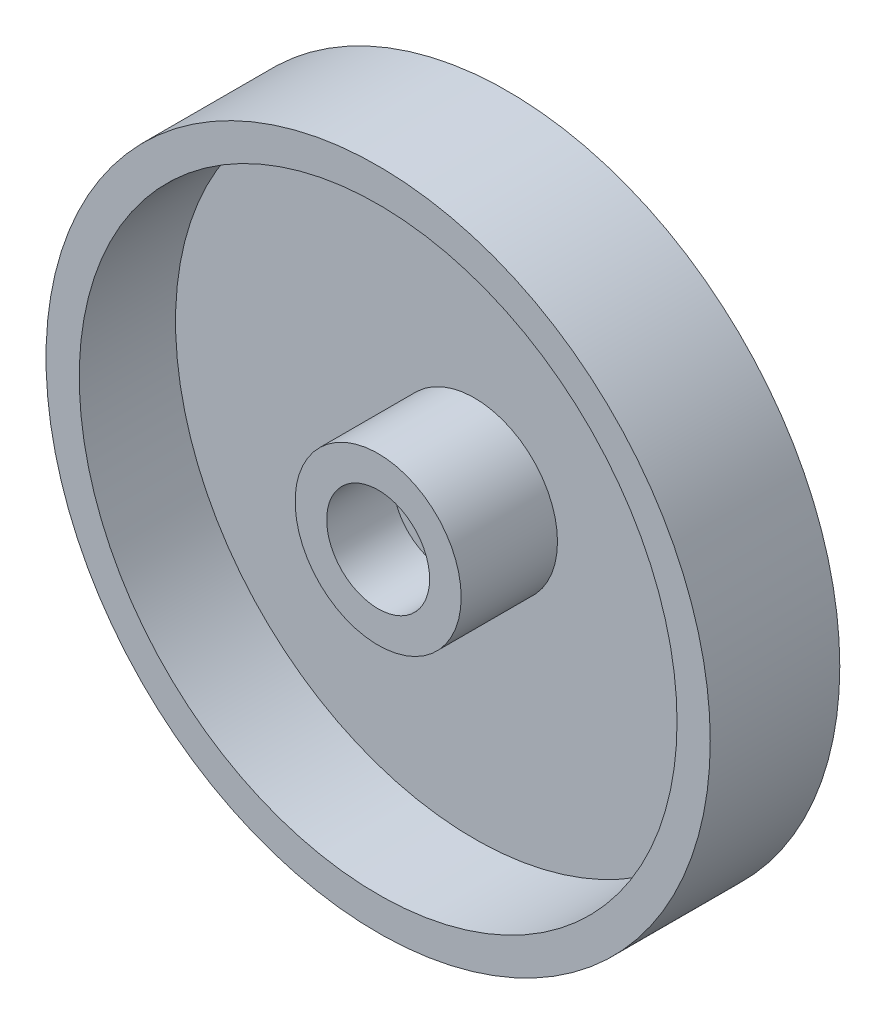
ISO-10303-21;
HEADER;
FILE_DESCRIPTION(('STEP AP214'),'2;1');
FILE_NAME('part.step','',(''),(''),'','','');
FILE_SCHEMA(('AUTOMOTIVE_DESIGN { 1 0 10303 214 1 1 1 1 }'));
ENDSEC;
DATA;
#1=APPLICATION_CONTEXT('core data for automotive mechanical design processes');
#2=APPLICATION_PROTOCOL_DEFINITION('international standard','automotive_design',2000,#1);
#3=PRODUCT_CONTEXT('',#1,'mechanical');
#4=PRODUCT('Part','Part','',(#3));
#5=PRODUCT_RELATED_PRODUCT_CATEGORY('part','',(#4));
#6=PRODUCT_DEFINITION_FORMATION('','',#4);
#7=PRODUCT_DEFINITION_CONTEXT('part definition',#1,'design');
#8=PRODUCT_DEFINITION('design','',#6,#7);
#9=PRODUCT_DEFINITION_SHAPE('','',#8);
#10=(LENGTH_UNIT() NAMED_UNIT(*) SI_UNIT(.MILLI.,.METRE.));
#11=(NAMED_UNIT(*) PLANE_ANGLE_UNIT() SI_UNIT($,.RADIAN.));
#12=(NAMED_UNIT(*) SI_UNIT($,.STERADIAN.) SOLID_ANGLE_UNIT());
#13=UNCERTAINTY_MEASURE_WITH_UNIT(LENGTH_MEASURE(1.E-05),#10,'distance_accuracy_value','');
#14=(GEOMETRIC_REPRESENTATION_CONTEXT(3) GLOBAL_UNCERTAINTY_ASSIGNED_CONTEXT((#13)) GLOBAL_UNIT_ASSIGNED_CONTEXT((#10,
#11,#12)) REPRESENTATION_CONTEXT('',''));
#15=CARTESIAN_POINT('',(0.,0.,0.));
#16=DIRECTION('',(0.,0.,1.));
#17=DIRECTION('',(1.,0.,0.));
#18=AXIS2_PLACEMENT_3D('',#15,#16,#17);
#19=CARTESIAN_POINT('',(0.,0.,4.));
#20=DIRECTION('',(0.,0.,-1.));
#21=DIRECTION('',(-1.,0.,0.));
#22=AXIS2_PLACEMENT_3D('',#19,#20,#21);
#23=CYLINDRICAL_SURFACE('',#22,18.);
#24=CARTESIAN_POINT('',(0.,0.,4.));
#25=DIRECTION('',(0.,0.,1.));
#26=DIRECTION('',(1.,0.,0.));
#27=AXIS2_PLACEMENT_3D('',#24,#25,#26);
#28=CIRCLE('',#27,18.);
#29=CARTESIAN_POINT('',(18.,0.,4.));
#30=VERTEX_POINT('',#29);
#31=EDGE_CURVE('E65',#30,#30,#28,.T.);
#32=ORIENTED_EDGE('',*,*,#31,.T.);
#33=EDGE_LOOP('',(#32));
#34=FACE_BOUND('',#33,.T.);
#35=CARTESIAN_POINT('',(0.,0.,-1.8));
#36=DIRECTION('',(0.,0.,1.));
#37=DIRECTION('',(1.,0.,0.));
#38=AXIS2_PLACEMENT_3D('',#35,#36,#37);
#39=CIRCLE('',#38,18.);
#40=CARTESIAN_POINT('',(18.,0.,-1.8));
#41=VERTEX_POINT('',#40);
#42=EDGE_CURVE('E73',#41,#41,#39,.T.);
#43=ORIENTED_EDGE('',*,*,#42,.F.);
#44=EDGE_LOOP('',(#43));
#45=FACE_BOUND('',#44,.T.);
#46=ADVANCED_FACE('F45',(#34,#45),#23,.F.);
#47=CARTESIAN_POINT('',(0.,0.,4.));
#48=DIRECTION('',(0.,0.,1.));
#49=DIRECTION('',(1.,0.,0.));
#50=AXIS2_PLACEMENT_3D('',#47,#48,#49);
#51=PLANE('',#50);
#52=ORIENTED_EDGE('',*,*,#31,.F.);
#53=EDGE_LOOP('',(#52));
#54=FACE_BOUND('',#53,.T.);
#55=CARTESIAN_POINT('',(0.,0.,4.));
#56=DIRECTION('',(0.,0.,1.));
#57=DIRECTION('',(1.,0.,0.));
#58=AXIS2_PLACEMENT_3D('',#55,#56,#57);
#59=CIRCLE('',#58,20.);
#60=CARTESIAN_POINT('',(20.,0.,4.));
#61=VERTEX_POINT('',#60);
#62=EDGE_CURVE('E61',#61,#61,#59,.T.);
#63=ORIENTED_EDGE('',*,*,#62,.T.);
#64=EDGE_LOOP('',(#63));
#65=FACE_BOUND('',#64,.T.);
#66=ADVANCED_FACE('F93',(#54,#65),#51,.T.);
#67=CARTESIAN_POINT('',(0.,0.,-2.));
#68=DIRECTION('',(0.,0.,1.));
#69=DIRECTION('',(1.,0.,0.));
#70=AXIS2_PLACEMENT_3D('',#67,#68,#69);
#71=CYLINDRICAL_SURFACE('',#70,20.);
#72=ORIENTED_EDGE('',*,*,#62,.F.);
#73=EDGE_LOOP('',(#72));
#74=FACE_BOUND('',#73,.T.);
#75=CARTESIAN_POINT('',(0.,0.,-3.8));
#76=DIRECTION('',(0.,0.,-1.));
#77=DIRECTION('',(-1.,0.,0.));
#78=AXIS2_PLACEMENT_3D('',#75,#76,#77);
#79=CIRCLE('',#78,20.);
#80=CARTESIAN_POINT('',(-20.,0.,-3.8));
#81=VERTEX_POINT('',#80);
#82=EDGE_CURVE('E69',#81,#81,#79,.T.);
#83=ORIENTED_EDGE('',*,*,#82,.F.);
#84=EDGE_LOOP('',(#83));
#85=FACE_BOUND('',#84,.T.);
#86=ADVANCED_FACE('F100',(#74,#85),#71,.T.);
#87=CARTESIAN_POINT('',(0.,0.,-3.8));
#88=DIRECTION('',(0.,0.,-1.));
#89=DIRECTION('',(-1.,0.,0.));
#90=AXIS2_PLACEMENT_3D('',#87,#88,#89);
#91=PLANE('',#90);
#92=ORIENTED_EDGE('',*,*,#82,.T.);
#93=EDGE_LOOP('',(#92));
#94=FACE_BOUND('',#93,.T.);
#95=ADVANCED_FACE('F88',(#94),#91,.T.);
#96=CARTESIAN_POINT('',(0.,0.,-1.8));
#97=DIRECTION('',(0.,0.,1.));
#98=DIRECTION('',(1.,0.,0.));
#99=AXIS2_PLACEMENT_3D('',#96,#97,#98);
#100=PLANE('',#99);
#101=CARTESIAN_POINT('',(0.,0.,-1.8));
#102=DIRECTION('',(0.,0.,1.));
#103=DIRECTION('',(1.,0.,0.));
#104=AXIS2_PLACEMENT_3D('',#101,#102,#103);
#105=CIRCLE('',#104,5.);
#106=CARTESIAN_POINT('',(5.,0.,-1.8));
#107=VERTEX_POINT('',#106);
#108=EDGE_CURVE('E77',#107,#107,#105,.T.);
#109=ORIENTED_EDGE('',*,*,#108,.F.);
#110=EDGE_LOOP('',(#109));
#111=FACE_BOUND('',#110,.T.);
#112=ORIENTED_EDGE('',*,*,#42,.T.);
#113=EDGE_LOOP('',(#112));
#114=FACE_BOUND('',#113,.T.);
#115=ADVANCED_FACE('F84',(#111,#114),#100,.T.);
#116=CARTESIAN_POINT('',(0.,0.,0.));
#117=DIRECTION('',(0.,0.,1.));
#118=DIRECTION('',(1.,0.,0.));
#119=AXIS2_PLACEMENT_3D('',#116,#117,#118);
#120=PLANE('',#119);
#121=CARTESIAN_POINT('',(0.,0.,0.));
#122=DIRECTION('',(0.,0.,1.));
#123=DIRECTION('',(1.,0.,0.));
#124=AXIS2_PLACEMENT_3D('',#121,#122,#123);
#125=CIRCLE('',#124,3.1);
#126=CARTESIAN_POINT('',(3.1,0.,0.));
#127=VERTEX_POINT('',#126);
#128=EDGE_CURVE('E49',#127,#127,#125,.T.);
#129=ORIENTED_EDGE('',*,*,#128,.T.);
#130=EDGE_LOOP('',(#129));
#131=FACE_BOUND('',#130,.T.);
#132=ADVANCED_FACE('F87',(#131),#120,.T.);
#133=CARTESIAN_POINT('',(0.,0.,4.));
#134=DIRECTION('',(0.,0.,-1.));
#135=DIRECTION('',(-1.,0.,0.));
#136=AXIS2_PLACEMENT_3D('',#133,#134,#135);
#137=CYLINDRICAL_SURFACE('',#136,3.1);
#138=CARTESIAN_POINT('',(0.,0.,4.));
#139=DIRECTION('',(0.,0.,1.));
#140=DIRECTION('',(1.,0.,0.));
#141=AXIS2_PLACEMENT_3D('',#138,#139,#140);
#142=CIRCLE('',#141,3.1);
#143=CARTESIAN_POINT('',(3.1,0.,4.));
#144=VERTEX_POINT('',#143);
#145=EDGE_CURVE('E54',#144,#144,#142,.T.);
#146=ORIENTED_EDGE('',*,*,#145,.T.);
#147=EDGE_LOOP('',(#146));
#148=FACE_BOUND('',#147,.T.);
#149=ORIENTED_EDGE('',*,*,#128,.F.);
#150=EDGE_LOOP('',(#149));
#151=FACE_BOUND('',#150,.T.);
#152=ADVANCED_FACE('F47',(#148,#151),#137,.F.);
#153=CARTESIAN_POINT('',(0.,0.,4.));
#154=DIRECTION('',(0.,0.,1.));
#155=DIRECTION('',(1.,0.,0.));
#156=AXIS2_PLACEMENT_3D('',#153,#154,#155);
#157=PLANE('',#156);
#158=ORIENTED_EDGE('',*,*,#145,.F.);
#159=EDGE_LOOP('',(#158));
#160=FACE_BOUND('',#159,.T.);
#161=CARTESIAN_POINT('',(0.,0.,4.));
#162=DIRECTION('',(0.,0.,1.));
#163=DIRECTION('',(1.,0.,0.));
#164=AXIS2_PLACEMENT_3D('',#161,#162,#163);
#165=CIRCLE('',#164,5.);
#166=CARTESIAN_POINT('',(5.,0.,4.));
#167=VERTEX_POINT('',#166);
#168=EDGE_CURVE('E11',#167,#167,#165,.T.);
#169=ORIENTED_EDGE('',*,*,#168,.T.);
#170=EDGE_LOOP('',(#169));
#171=FACE_BOUND('',#170,.T.);
#172=ADVANCED_FACE('F110',(#160,#171),#157,.T.);
#173=CARTESIAN_POINT('',(0.,0.,4.));
#174=DIRECTION('',(0.,0.,-1.));
#175=DIRECTION('',(-1.,0.,0.));
#176=AXIS2_PLACEMENT_3D('',#173,#174,#175);
#177=CYLINDRICAL_SURFACE('',#176,5.);
#178=ORIENTED_EDGE('',*,*,#168,.F.);
#179=EDGE_LOOP('',(#178));
#180=FACE_BOUND('',#179,.T.);
#181=ORIENTED_EDGE('',*,*,#108,.T.);
#182=EDGE_LOOP('',(#181));
#183=FACE_BOUND('',#182,.T.);
#184=ADVANCED_FACE('F82',(#180,#183),#177,.T.);
#185=CLOSED_SHELL('',(#46,#66,#86,#95,#115,#132,#152,#172,#184));
#186=MANIFOLD_SOLID_BREP('B2',#185);
#187=ADVANCED_BREP_SHAPE_REPRESENTATION('',(#18,#186),#14);
#188=SHAPE_DEFINITION_REPRESENTATION(#9,#187);
ENDSEC;
END-ISO-10303-21;
